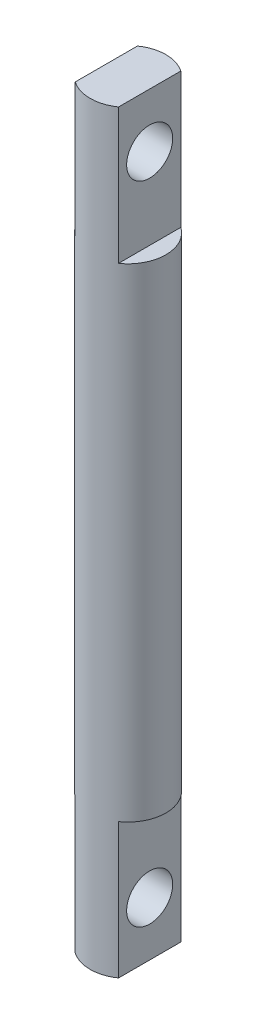
ISO-10303-21;
HEADER;
FILE_DESCRIPTION(('STEP AP214'),'2;1');
FILE_NAME('part.step','',(''),(''),'','','');
FILE_SCHEMA(('AUTOMOTIVE_DESIGN { 1 0 10303 214 1 1 1 1 }'));
ENDSEC;
DATA;
#1=APPLICATION_CONTEXT('core data for automotive mechanical design processes');
#2=APPLICATION_PROTOCOL_DEFINITION('international standard','automotive_design',2000,#1);
#3=PRODUCT_CONTEXT('',#1,'mechanical');
#4=PRODUCT('Part','Part','',(#3));
#5=PRODUCT_RELATED_PRODUCT_CATEGORY('part','',(#4));
#6=PRODUCT_DEFINITION_FORMATION('','',#4);
#7=PRODUCT_DEFINITION_CONTEXT('part definition',#1,'design');
#8=PRODUCT_DEFINITION('design','',#6,#7);
#9=PRODUCT_DEFINITION_SHAPE('','',#8);
#10=(LENGTH_UNIT() NAMED_UNIT(*) SI_UNIT(.MILLI.,.METRE.));
#11=(NAMED_UNIT(*) PLANE_ANGLE_UNIT() SI_UNIT($,.RADIAN.));
#12=(NAMED_UNIT(*) SI_UNIT($,.STERADIAN.) SOLID_ANGLE_UNIT());
#13=UNCERTAINTY_MEASURE_WITH_UNIT(LENGTH_MEASURE(1.E-05),#10,'distance_accuracy_value','');
#14=(GEOMETRIC_REPRESENTATION_CONTEXT(3) GLOBAL_UNCERTAINTY_ASSIGNED_CONTEXT((#13)) GLOBAL_UNIT_ASSIGNED_CONTEXT((#10,
#11,#12)) REPRESENTATION_CONTEXT('',''));
#15=CARTESIAN_POINT('',(0.,0.,0.));
#16=DIRECTION('',(0.,0.,1.));
#17=DIRECTION('',(1.,0.,0.));
#18=AXIS2_PLACEMENT_3D('',#15,#16,#17);
#19=CARTESIAN_POINT('',(0.,139.254,0.));
#20=DIRECTION('',(0.,-1.,0.));
#21=DIRECTION('',(0.,0.,-1.));
#22=AXIS2_PLACEMENT_3D('',#19,#20,#21);
#23=CYLINDRICAL_SURFACE('',#22,7.);
#24=CARTESIAN_POINT('',(0.,139.254,0.));
#25=DIRECTION('',(0.,1.,0.));
#26=DIRECTION('',(0.,0.,1.));
#27=AXIS2_PLACEMENT_3D('',#24,#25,#26);
#28=CIRCLE('',#27,7.);
#29=CARTESIAN_POINT('',(4.,139.254,-5.74456264653803));
#30=VERTEX_POINT('',#29);
#31=CARTESIAN_POINT('',(-4.,139.254,-5.74456264653803));
#32=VERTEX_POINT('',#31);
#33=EDGE_CURVE('E115',#30,#32,#28,.T.);
#34=ORIENTED_EDGE('',*,*,#33,.F.);
#35=DIRECTION('',(0.,-1.,0.));
#36=VECTOR('',#35,1.);
#37=CARTESIAN_POINT('',(4.,139.254,-5.74456264653803));
#38=LINE('',#37,#36);
#39=CARTESIAN_POINT('',(4.,114.254,-5.74456264653803));
#40=VERTEX_POINT('',#39);
#41=EDGE_CURVE('E47',#30,#40,#38,.T.);
#42=ORIENTED_EDGE('',*,*,#41,.T.);
#43=CARTESIAN_POINT('',(0.,114.254,0.));
#44=DIRECTION('',(0.,1.,0.));
#45=DIRECTION('',(0.,0.,1.));
#46=AXIS2_PLACEMENT_3D('',#43,#44,#45);
#47=CIRCLE('',#46,7.);
#48=CARTESIAN_POINT('',(4.,114.254,5.74456264653803));
#49=VERTEX_POINT('',#48);
#50=EDGE_CURVE('E11',#49,#40,#47,.T.);
#51=ORIENTED_EDGE('',*,*,#50,.F.);
#52=DIRECTION('',(0.,-1.,0.));
#53=VECTOR('',#52,1.);
#54=CARTESIAN_POINT('',(4.,139.254,5.74456264653803));
#55=LINE('',#54,#53);
#56=CARTESIAN_POINT('',(4.,139.254,5.74456264653803));
#57=VERTEX_POINT('',#56);
#58=EDGE_CURVE('E98',#49,#57,#55,.F.);
#59=ORIENTED_EDGE('',*,*,#58,.T.);
#60=CARTESIAN_POINT('',(-4.,139.254,5.74456264653803));
#61=VERTEX_POINT('',#60);
#62=EDGE_CURVE('E109',#61,#57,#28,.T.);
#63=ORIENTED_EDGE('',*,*,#62,.F.);
#64=DIRECTION('',(0.,-1.,0.));
#65=VECTOR('',#64,1.);
#66=CARTESIAN_POINT('',(-4.,139.254,5.74456264653803));
#67=LINE('',#66,#65);
#68=CARTESIAN_POINT('',(-4.,114.254,5.74456264653803));
#69=VERTEX_POINT('',#68);
#70=EDGE_CURVE('E55',#61,#69,#67,.T.);
#71=ORIENTED_EDGE('',*,*,#70,.T.);
#72=CARTESIAN_POINT('',(0.,114.254,0.));
#73=DIRECTION('',(0.,-1.,0.));
#74=DIRECTION('',(0.,0.,-1.));
#75=AXIS2_PLACEMENT_3D('',#72,#73,#74);
#76=CIRCLE('',#75,7.);
#77=CARTESIAN_POINT('',(-4.,114.254,-5.74456264653803));
#78=VERTEX_POINT('',#77);
#79=EDGE_CURVE('E103',#69,#78,#76,.T.);
#80=ORIENTED_EDGE('',*,*,#79,.T.);
#81=DIRECTION('',(0.,-1.,0.));
#82=VECTOR('',#81,1.);
#83=CARTESIAN_POINT('',(-4.,139.254,-5.74456264653803));
#84=LINE('',#83,#82);
#85=EDGE_CURVE('E138',#78,#32,#84,.F.);
#86=ORIENTED_EDGE('',*,*,#85,.T.);
#87=EDGE_LOOP('',(#34,#42,#51,#59,#63,#71,#80,#86));
#88=FACE_BOUND('',#87,.T.);
#89=CARTESIAN_POINT('',(0.,25.,0.));
#90=DIRECTION('',(0.,1.,0.));
#91=DIRECTION('',(0.,0.,1.));
#92=AXIS2_PLACEMENT_3D('',#89,#90,#91);
#93=CIRCLE('',#92,7.);
#94=CARTESIAN_POINT('',(-4.,25.,-5.74456264653803));
#95=VERTEX_POINT('',#94);
#96=CARTESIAN_POINT('',(-4.,25.,5.74456264653803));
#97=VERTEX_POINT('',#96);
#98=EDGE_CURVE('E132',#95,#97,#93,.T.);
#99=ORIENTED_EDGE('',*,*,#98,.T.);
#100=DIRECTION('',(0.,-1.,0.));
#101=VECTOR('',#100,1.);
#102=CARTESIAN_POINT('',(-4.,139.254,5.74456264653803));
#103=LINE('',#102,#101);
#104=CARTESIAN_POINT('',(-4.,0.,5.74456264653803));
#105=VERTEX_POINT('',#104);
#106=EDGE_CURVE('E155',#97,#105,#103,.T.);
#107=ORIENTED_EDGE('',*,*,#106,.T.);
#108=CARTESIAN_POINT('',(0.,0.,0.));
#109=DIRECTION('',(0.,1.,0.));
#110=DIRECTION('',(0.,0.,1.));
#111=AXIS2_PLACEMENT_3D('',#108,#109,#110);
#112=CIRCLE('',#111,7.);
#113=CARTESIAN_POINT('',(4.,0.,5.74456264653803));
#114=VERTEX_POINT('',#113);
#115=EDGE_CURVE('E126',#105,#114,#112,.T.);
#116=ORIENTED_EDGE('',*,*,#115,.T.);
#117=DIRECTION('',(0.,-1.,0.));
#118=VECTOR('',#117,1.);
#119=CARTESIAN_POINT('',(4.,139.254,5.74456264653803));
#120=LINE('',#119,#118);
#121=CARTESIAN_POINT('',(4.,25.,5.74456264653803));
#122=VERTEX_POINT('',#121);
#123=EDGE_CURVE('E160',#114,#122,#120,.F.);
#124=ORIENTED_EDGE('',*,*,#123,.T.);
#125=CARTESIAN_POINT('',(0.,25.,0.));
#126=DIRECTION('',(0.,-1.,0.));
#127=DIRECTION('',(0.,0.,-1.));
#128=AXIS2_PLACEMENT_3D('',#125,#126,#127);
#129=CIRCLE('',#128,7.);
#130=CARTESIAN_POINT('',(4.,25.,-5.74456264653803));
#131=VERTEX_POINT('',#130);
#132=EDGE_CURVE('E118',#131,#122,#129,.T.);
#133=ORIENTED_EDGE('',*,*,#132,.F.);
#134=DIRECTION('',(0.,-1.,0.));
#135=VECTOR('',#134,1.);
#136=CARTESIAN_POINT('',(4.,139.254,-5.74456264653803));
#137=LINE('',#136,#135);
#138=CARTESIAN_POINT('',(4.,0.,-5.74456264653803));
#139=VERTEX_POINT('',#138);
#140=EDGE_CURVE('E123',#131,#139,#137,.T.);
#141=ORIENTED_EDGE('',*,*,#140,.T.);
#142=CARTESIAN_POINT('',(-4.,0.,-5.74456264653803));
#143=VERTEX_POINT('',#142);
#144=EDGE_CURVE('E120',#139,#143,#112,.T.);
#145=ORIENTED_EDGE('',*,*,#144,.T.);
#146=DIRECTION('',(0.,-1.,0.));
#147=VECTOR('',#146,1.);
#148=CARTESIAN_POINT('',(-4.,139.254,-5.74456264653803));
#149=LINE('',#148,#147);
#150=EDGE_CURVE('E152',#143,#95,#149,.F.);
#151=ORIENTED_EDGE('',*,*,#150,.T.);
#152=EDGE_LOOP('',(#99,#107,#116,#124,#133,#141,#145,#151));
#153=FACE_BOUND('',#152,.T.);
#154=ADVANCED_FACE('F32',(#88,#153),#23,.T.);
#155=CARTESIAN_POINT('',(0.,139.254,0.));
#156=DIRECTION('',(0.,1.,0.));
#157=DIRECTION('',(0.,0.,1.));
#158=AXIS2_PLACEMENT_3D('',#155,#156,#157);
#159=PLANE('',#158);
#160=DIRECTION('',(0.,0.,1.));
#161=VECTOR('',#160,1.);
#162=CARTESIAN_POINT('',(4.,139.254,0.));
#163=LINE('',#162,#161);
#164=EDGE_CURVE('E40',#30,#57,#163,.T.);
#165=ORIENTED_EDGE('',*,*,#164,.F.);
#166=ORIENTED_EDGE('',*,*,#33,.T.);
#167=DIRECTION('',(0.,0.,-1.));
#168=VECTOR('',#167,1.);
#169=CARTESIAN_POINT('',(-4.,139.254,0.));
#170=LINE('',#169,#168);
#171=EDGE_CURVE('E113',#61,#32,#170,.T.);
#172=ORIENTED_EDGE('',*,*,#171,.F.);
#173=ORIENTED_EDGE('',*,*,#62,.T.);
#174=EDGE_LOOP('',(#165,#166,#172,#173));
#175=FACE_BOUND('',#174,.T.);
#176=ADVANCED_FACE('F112',(#175),#159,.T.);
#177=CARTESIAN_POINT('',(0.,0.,0.));
#178=DIRECTION('',(0.,1.,0.));
#179=DIRECTION('',(0.,0.,1.));
#180=AXIS2_PLACEMENT_3D('',#177,#178,#179);
#181=PLANE('',#180);
#182=ORIENTED_EDGE('',*,*,#115,.F.);
#183=DIRECTION('',(0.,0.,-1.));
#184=VECTOR('',#183,1.);
#185=CARTESIAN_POINT('',(-4.,0.,0.));
#186=LINE('',#185,#184);
#187=EDGE_CURVE('E129',#105,#143,#186,.T.);
#188=ORIENTED_EDGE('',*,*,#187,.T.);
#189=ORIENTED_EDGE('',*,*,#144,.F.);
#190=DIRECTION('',(0.,0.,1.));
#191=VECTOR('',#190,1.);
#192=CARTESIAN_POINT('',(4.,0.,0.));
#193=LINE('',#192,#191);
#194=EDGE_CURVE('E114',#139,#114,#193,.T.);
#195=ORIENTED_EDGE('',*,*,#194,.T.);
#196=EDGE_LOOP('',(#182,#188,#189,#195));
#197=FACE_BOUND('',#196,.T.);
#198=ADVANCED_FACE('F171',(#197),#181,.F.);
#199=CARTESIAN_POINT('',(0.,25.,0.));
#200=DIRECTION('',(0.,-1.,0.));
#201=DIRECTION('',(0.,0.,-1.));
#202=AXIS2_PLACEMENT_3D('',#199,#200,#201);
#203=PLANE('',#202);
#204=ORIENTED_EDGE('',*,*,#132,.T.);
#205=DIRECTION('',(0.,0.,-1.));
#206=VECTOR('',#205,1.);
#207=CARTESIAN_POINT('',(4.,25.,9.09250577199634));
#208=LINE('',#207,#206);
#209=EDGE_CURVE('E158',#122,#131,#208,.T.);
#210=ORIENTED_EDGE('',*,*,#209,.T.);
#211=EDGE_LOOP('',(#204,#210));
#212=FACE_BOUND('',#211,.T.);
#213=ADVANCED_FACE('F187',(#212),#203,.T.);
#214=CARTESIAN_POINT('',(4.,25.,9.09250577199634));
#215=DIRECTION('',(-1.,0.,0.));
#216=DIRECTION('',(0.,0.,1.));
#217=AXIS2_PLACEMENT_3D('',#214,#215,#216);
#218=PLANE('',#217);
#219=CARTESIAN_POINT('',(4.,10.,0.));
#220=DIRECTION('',(1.,0.,0.));
#221=DIRECTION('',(0.,0.,-1.));
#222=AXIS2_PLACEMENT_3D('',#219,#220,#221);
#223=CIRCLE('',#222,4.25);
#224=CARTESIAN_POINT('',(4.,10.,-4.25));
#225=VERTEX_POINT('',#224);
#226=EDGE_CURVE('E295',#225,#225,#223,.T.);
#227=ORIENTED_EDGE('',*,*,#226,.F.);
#228=EDGE_LOOP('',(#227));
#229=FACE_BOUND('',#228,.T.);
#230=ORIENTED_EDGE('',*,*,#209,.F.);
#231=ORIENTED_EDGE('',*,*,#123,.F.);
#232=ORIENTED_EDGE('',*,*,#194,.F.);
#233=ORIENTED_EDGE('',*,*,#140,.F.);
#234=EDGE_LOOP('',(#230,#231,#232,#233));
#235=FACE_BOUND('',#234,.T.);
#236=ADVANCED_FACE('F170',(#229,#235),#218,.F.);
#237=CARTESIAN_POINT('',(0.,25.,0.));
#238=DIRECTION('',(0.,1.,0.));
#239=DIRECTION('',(0.,0.,1.));
#240=AXIS2_PLACEMENT_3D('',#237,#238,#239);
#241=PLANE('',#240);
#242=DIRECTION('',(0.,0.,1.));
#243=VECTOR('',#242,1.);
#244=CARTESIAN_POINT('',(-4.,25.,9.09250577199633));
#245=LINE('',#244,#243);
#246=EDGE_CURVE('E149',#95,#97,#245,.T.);
#247=ORIENTED_EDGE('',*,*,#246,.T.);
#248=ORIENTED_EDGE('',*,*,#98,.F.);
#249=EDGE_LOOP('',(#247,#248));
#250=FACE_BOUND('',#249,.T.);
#251=ADVANCED_FACE('F176',(#250),#241,.F.);
#252=CARTESIAN_POINT('',(-4.,25.,9.09250577199633));
#253=DIRECTION('',(1.,0.,0.));
#254=DIRECTION('',(0.,0.,-1.));
#255=AXIS2_PLACEMENT_3D('',#252,#253,#254);
#256=PLANE('',#255);
#257=CARTESIAN_POINT('',(-4.,10.,0.));
#258=DIRECTION('',(1.,0.,0.));
#259=DIRECTION('',(0.,0.,-1.));
#260=AXIS2_PLACEMENT_3D('',#257,#258,#259);
#261=CIRCLE('',#260,4.25);
#262=CARTESIAN_POINT('',(-4.,10.,-4.25));
#263=VERTEX_POINT('',#262);
#264=EDGE_CURVE('E35',#263,#263,#261,.T.);
#265=ORIENTED_EDGE('',*,*,#264,.T.);
#266=EDGE_LOOP('',(#265));
#267=FACE_BOUND('',#266,.T.);
#268=ORIENTED_EDGE('',*,*,#246,.F.);
#269=ORIENTED_EDGE('',*,*,#150,.F.);
#270=ORIENTED_EDGE('',*,*,#187,.F.);
#271=ORIENTED_EDGE('',*,*,#106,.F.);
#272=EDGE_LOOP('',(#268,#269,#270,#271));
#273=FACE_BOUND('',#272,.T.);
#274=ADVANCED_FACE('F174',(#267,#273),#256,.F.);
#275=CARTESIAN_POINT('',(0.,114.254,0.));
#276=DIRECTION('',(0.,-1.,0.));
#277=DIRECTION('',(0.,0.,-1.));
#278=AXIS2_PLACEMENT_3D('',#275,#276,#277);
#279=PLANE('',#278);
#280=DIRECTION('',(0.,0.,-1.));
#281=VECTOR('',#280,1.);
#282=CARTESIAN_POINT('',(-4.,114.254,-8.91203226758534));
#283=LINE('',#282,#281);
#284=EDGE_CURVE('E142',#69,#78,#283,.T.);
#285=ORIENTED_EDGE('',*,*,#284,.T.);
#286=ORIENTED_EDGE('',*,*,#79,.F.);
#287=EDGE_LOOP('',(#285,#286));
#288=FACE_BOUND('',#287,.T.);
#289=ADVANCED_FACE('F141',(#288),#279,.F.);
#290=CARTESIAN_POINT('',(-4.,114.254,-8.91203226758534));
#291=DIRECTION('',(1.,0.,0.));
#292=DIRECTION('',(0.,0.,-1.));
#293=AXIS2_PLACEMENT_3D('',#290,#291,#292);
#294=PLANE('',#293);
#295=CARTESIAN_POINT('',(-4.,129.254,0.));
#296=DIRECTION('',(1.,0.,0.));
#297=DIRECTION('',(0.,0.,-1.));
#298=AXIS2_PLACEMENT_3D('',#295,#296,#297);
#299=CIRCLE('',#298,4.25);
#300=CARTESIAN_POINT('',(-4.,129.254,-4.25));
#301=VERTEX_POINT('',#300);
#302=EDGE_CURVE('E299',#301,#301,#299,.T.);
#303=ORIENTED_EDGE('',*,*,#302,.T.);
#304=EDGE_LOOP('',(#303));
#305=FACE_BOUND('',#304,.T.);
#306=ORIENTED_EDGE('',*,*,#171,.T.);
#307=ORIENTED_EDGE('',*,*,#85,.F.);
#308=ORIENTED_EDGE('',*,*,#284,.F.);
#309=ORIENTED_EDGE('',*,*,#70,.F.);
#310=EDGE_LOOP('',(#306,#307,#308,#309));
#311=FACE_BOUND('',#310,.T.);
#312=ADVANCED_FACE('F143',(#305,#311),#294,.F.);
#313=CARTESIAN_POINT('',(0.,114.254,0.));
#314=DIRECTION('',(0.,1.,0.));
#315=DIRECTION('',(0.,0.,1.));
#316=AXIS2_PLACEMENT_3D('',#313,#314,#315);
#317=PLANE('',#316);
#318=ORIENTED_EDGE('',*,*,#50,.T.);
#319=DIRECTION('',(0.,0.,1.));
#320=VECTOR('',#319,1.);
#321=CARTESIAN_POINT('',(4.,114.254,-8.91203226758534));
#322=LINE('',#321,#320);
#323=EDGE_CURVE('E110',#40,#49,#322,.T.);
#324=ORIENTED_EDGE('',*,*,#323,.T.);
#325=EDGE_LOOP('',(#318,#324));
#326=FACE_BOUND('',#325,.T.);
#327=ADVANCED_FACE('F215',(#326),#317,.T.);
#328=CARTESIAN_POINT('',(4.,114.254,-8.91203226758534));
#329=DIRECTION('',(-1.,0.,0.));
#330=DIRECTION('',(0.,0.,1.));
#331=AXIS2_PLACEMENT_3D('',#328,#329,#330);
#332=PLANE('',#331);
#333=CARTESIAN_POINT('',(4.,129.254,0.));
#334=DIRECTION('',(1.,0.,0.));
#335=DIRECTION('',(0.,0.,-1.));
#336=AXIS2_PLACEMENT_3D('',#333,#334,#335);
#337=CIRCLE('',#336,4.25);
#338=CARTESIAN_POINT('',(4.,129.254,-4.25));
#339=VERTEX_POINT('',#338);
#340=EDGE_CURVE('E302',#339,#339,#337,.T.);
#341=ORIENTED_EDGE('',*,*,#340,.F.);
#342=EDGE_LOOP('',(#341));
#343=FACE_BOUND('',#342,.T.);
#344=ORIENTED_EDGE('',*,*,#164,.T.);
#345=ORIENTED_EDGE('',*,*,#58,.F.);
#346=ORIENTED_EDGE('',*,*,#323,.F.);
#347=ORIENTED_EDGE('',*,*,#41,.F.);
#348=EDGE_LOOP('',(#344,#345,#346,#347));
#349=FACE_BOUND('',#348,.T.);
#350=ADVANCED_FACE('F97',(#343,#349),#332,.F.);
#351=CARTESIAN_POINT('',(4.,10.,0.));
#352=DIRECTION('',(1.,0.,0.));
#353=DIRECTION('',(0.,0.,-1.));
#354=AXIS2_PLACEMENT_3D('',#351,#352,#353);
#355=CYLINDRICAL_SURFACE('',#354,4.25);
#356=ORIENTED_EDGE('',*,*,#226,.T.);
#357=EDGE_LOOP('',(#356));
#358=FACE_BOUND('',#357,.T.);
#359=ORIENTED_EDGE('',*,*,#264,.F.);
#360=EDGE_LOOP('',(#359));
#361=FACE_BOUND('',#360,.T.);
#362=ADVANCED_FACE('F234',(#358,#361),#355,.F.);
#363=CARTESIAN_POINT('',(4.,129.254,0.));
#364=DIRECTION('',(1.,0.,0.));
#365=DIRECTION('',(0.,0.,-1.));
#366=AXIS2_PLACEMENT_3D('',#363,#364,#365);
#367=CYLINDRICAL_SURFACE('',#366,4.25);
#368=ORIENTED_EDGE('',*,*,#340,.T.);
#369=EDGE_LOOP('',(#368));
#370=FACE_BOUND('',#369,.T.);
#371=ORIENTED_EDGE('',*,*,#302,.F.);
#372=EDGE_LOOP('',(#371));
#373=FACE_BOUND('',#372,.T.);
#374=ADVANCED_FACE('F243',(#370,#373),#367,.F.);
#375=CLOSED_SHELL('',(#154,#176,#198,#213,#236,#251,#274,#289,#312,#327,#350,#362,#374));
#376=MANIFOLD_SOLID_BREP('B2',#375);
#377=ADVANCED_BREP_SHAPE_REPRESENTATION('',(#18,#376),#14);
#378=SHAPE_DEFINITION_REPRESENTATION(#9,#377);
ENDSEC;
END-ISO-10303-21;
